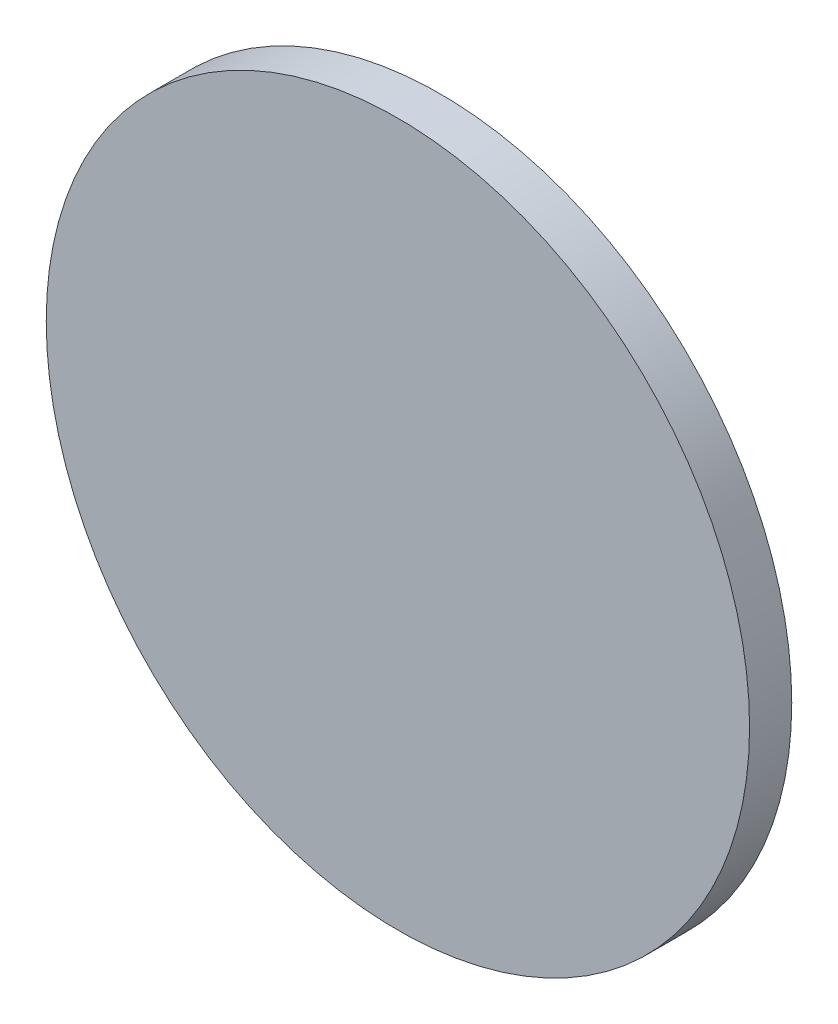
ISO-10303-21;
HEADER;
FILE_DESCRIPTION(('STEP AP214'),'2;1');
FILE_NAME('part.step','',(''),(''),'','','');
FILE_SCHEMA(('AUTOMOTIVE_DESIGN { 1 0 10303 214 1 1 1 1 }'));
ENDSEC;
DATA;
#1=APPLICATION_CONTEXT('core data for automotive mechanical design processes');
#2=APPLICATION_PROTOCOL_DEFINITION('international standard','automotive_design',2000,#1);
#3=PRODUCT_CONTEXT('',#1,'mechanical');
#4=PRODUCT('Part','Part','',(#3));
#5=PRODUCT_RELATED_PRODUCT_CATEGORY('part','',(#4));
#6=PRODUCT_DEFINITION_FORMATION('','',#4);
#7=PRODUCT_DEFINITION_CONTEXT('part definition',#1,'design');
#8=PRODUCT_DEFINITION('design','',#6,#7);
#9=PRODUCT_DEFINITION_SHAPE('','',#8);
#10=(LENGTH_UNIT() NAMED_UNIT(*) SI_UNIT(.MILLI.,.METRE.));
#11=(NAMED_UNIT(*) PLANE_ANGLE_UNIT() SI_UNIT($,.RADIAN.));
#12=(NAMED_UNIT(*) SI_UNIT($,.STERADIAN.) SOLID_ANGLE_UNIT());
#13=UNCERTAINTY_MEASURE_WITH_UNIT(LENGTH_MEASURE(1.E-05),#10,'distance_accuracy_value','');
#14=(GEOMETRIC_REPRESENTATION_CONTEXT(3) GLOBAL_UNCERTAINTY_ASSIGNED_CONTEXT((#13)) GLOBAL_UNIT_ASSIGNED_CONTEXT((#10,
#11,#12)) REPRESENTATION_CONTEXT('',''));
#15=CARTESIAN_POINT('',(0.,0.,0.));
#16=DIRECTION('',(0.,0.,1.));
#17=DIRECTION('',(1.,0.,0.));
#18=AXIS2_PLACEMENT_3D('',#15,#16,#17);
#19=CARTESIAN_POINT('',(0.,0.,3.));
#20=DIRECTION('',(0.,0.,-1.));
#21=DIRECTION('',(-1.,0.,0.));
#22=AXIS2_PLACEMENT_3D('',#19,#20,#21);
#23=CYLINDRICAL_SURFACE('',#22,25.);
#24=CARTESIAN_POINT('',(0.,0.,3.));
#25=DIRECTION('',(0.,0.,1.));
#26=DIRECTION('',(1.,0.,0.));
#27=AXIS2_PLACEMENT_3D('',#24,#25,#26);
#28=CIRCLE('',#27,25.);
#29=CARTESIAN_POINT('',(25.,0.,3.));
#30=VERTEX_POINT('',#29);
#31=EDGE_CURVE('E10',#30,#30,#28,.T.);
#32=ORIENTED_EDGE('',*,*,#31,.F.);
#33=EDGE_LOOP('',(#32));
#34=FACE_BOUND('',#33,.T.);
#35=CARTESIAN_POINT('',(0.,0.,0.));
#36=DIRECTION('',(0.,0.,1.));
#37=DIRECTION('',(1.,0.,0.));
#38=AXIS2_PLACEMENT_3D('',#35,#36,#37);
#39=CIRCLE('',#38,25.);
#40=CARTESIAN_POINT('',(25.,0.,0.));
#41=VERTEX_POINT('',#40);
#42=EDGE_CURVE('E40',#41,#41,#39,.T.);
#43=ORIENTED_EDGE('',*,*,#42,.T.);
#44=EDGE_LOOP('',(#43));
#45=FACE_BOUND('',#44,.T.);
#46=ADVANCED_FACE('F37',(#34,#45),#23,.T.);
#47=CARTESIAN_POINT('',(0.,0.,3.));
#48=DIRECTION('',(0.,0.,1.));
#49=DIRECTION('',(1.,0.,0.));
#50=AXIS2_PLACEMENT_3D('',#47,#48,#49);
#51=PLANE('',#50);
#52=ORIENTED_EDGE('',*,*,#31,.T.);
#53=EDGE_LOOP('',(#52));
#54=FACE_BOUND('',#53,.T.);
#55=ADVANCED_FACE('F54',(#54),#51,.T.);
#56=CARTESIAN_POINT('',(0.,0.,0.));
#57=DIRECTION('',(0.,0.,1.));
#58=DIRECTION('',(1.,0.,0.));
#59=AXIS2_PLACEMENT_3D('',#56,#57,#58);
#60=PLANE('',#59);
#61=ORIENTED_EDGE('',*,*,#42,.F.);
#62=EDGE_LOOP('',(#61));
#63=FACE_BOUND('',#62,.T.);
#64=ADVANCED_FACE('F52',(#63),#60,.F.);
#65=CLOSED_SHELL('',(#46,#55,#64));
#66=MANIFOLD_SOLID_BREP('B2',#65);
#67=ADVANCED_BREP_SHAPE_REPRESENTATION('',(#18,#66),#14);
#68=SHAPE_DEFINITION_REPRESENTATION(#9,#67);
ENDSEC;
END-ISO-10303-21;
